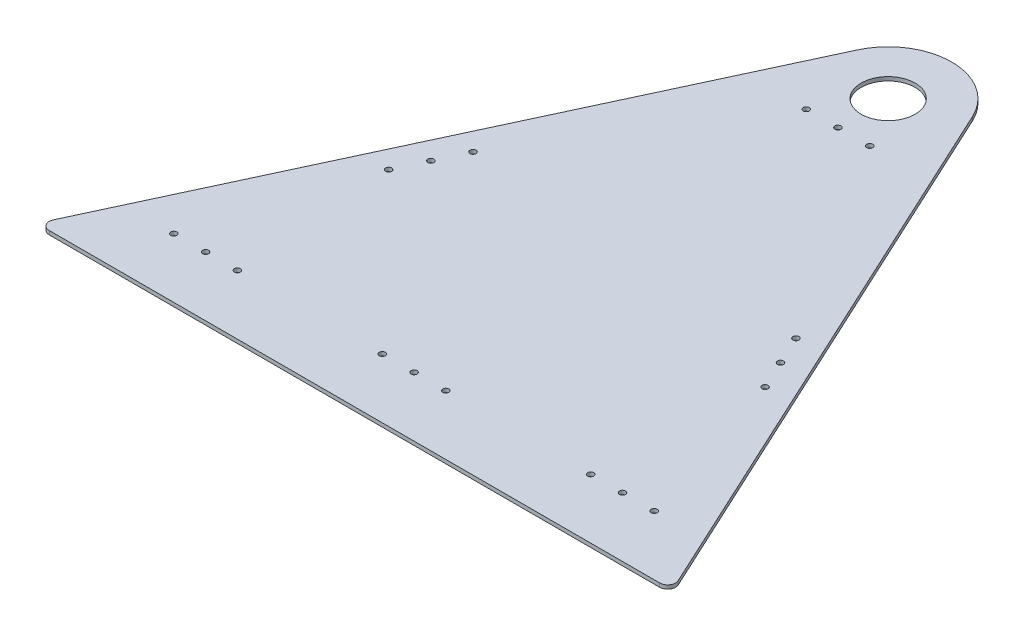
ISO-10303-21;
HEADER;
FILE_DESCRIPTION(('STEP AP214'),'2;1');
FILE_NAME('part.step','',(''),(''),'','','');
FILE_SCHEMA(('AUTOMOTIVE_DESIGN { 1 0 10303 214 1 1 1 1 }'));
ENDSEC;
DATA;
#1=APPLICATION_CONTEXT('core data for automotive mechanical design processes');
#2=APPLICATION_PROTOCOL_DEFINITION('international standard','automotive_design',2000,#1);
#3=PRODUCT_CONTEXT('',#1,'mechanical');
#4=PRODUCT('Part','Part','',(#3));
#5=PRODUCT_RELATED_PRODUCT_CATEGORY('part','',(#4));
#6=PRODUCT_DEFINITION_FORMATION('','',#4);
#7=PRODUCT_DEFINITION_CONTEXT('part definition',#1,'design');
#8=PRODUCT_DEFINITION('design','',#6,#7);
#9=PRODUCT_DEFINITION_SHAPE('','',#8);
#10=(LENGTH_UNIT() NAMED_UNIT(*) SI_UNIT(.MILLI.,.METRE.));
#11=(NAMED_UNIT(*) PLANE_ANGLE_UNIT() SI_UNIT($,.RADIAN.));
#12=(NAMED_UNIT(*) SI_UNIT($,.STERADIAN.) SOLID_ANGLE_UNIT());
#13=UNCERTAINTY_MEASURE_WITH_UNIT(LENGTH_MEASURE(1.E-05),#10,'distance_accuracy_value','');
#14=(GEOMETRIC_REPRESENTATION_CONTEXT(3) GLOBAL_UNCERTAINTY_ASSIGNED_CONTEXT((#13)) GLOBAL_UNIT_ASSIGNED_CONTEXT((#10,
#11,#12)) REPRESENTATION_CONTEXT('',''));
#15=CARTESIAN_POINT('',(0.,0.,0.));
#16=DIRECTION('',(0.,0.,1.));
#17=DIRECTION('',(1.,0.,0.));
#18=AXIS2_PLACEMENT_3D('',#15,#16,#17);
#19=CARTESIAN_POINT('',(254.,-3.03784,-426.72));
#20=DIRECTION('',(0.,1.,0.));
#21=DIRECTION('',(0.,0.,1.));
#22=AXIS2_PLACEMENT_3D('',#19,#20,#21);
#23=CYLINDRICAL_SURFACE('',#22,50.8000000000005);
#24=CARTESIAN_POINT('',(254.,0.,-426.72));
#25=DIRECTION('',(0.,1.,0.));
#26=DIRECTION('',(0.,0.,-1.));
#27=AXIS2_PLACEMENT_3D('',#24,#25,#26);
#28=CIRCLE('',#27,50.8000000000005);
#29=CARTESIAN_POINT('',(300.081092337626,0.,-448.10160258192));
#30=VERTEX_POINT('',#29);
#31=CARTESIAN_POINT('',(207.918907662373,0.,-448.101602581921));
#32=VERTEX_POINT('',#31);
#33=EDGE_CURVE('E123',#30,#32,#28,.T.);
#34=ORIENTED_EDGE('',*,*,#33,.F.);
#35=DIRECTION('',(0.,1.,0.));
#36=VECTOR('',#35,1.);
#37=CARTESIAN_POINT('',(300.081092337626,-3.03784,-448.10160258192));
#38=LINE('',#37,#36);
#39=CARTESIAN_POINT('',(300.081092337626,-3.03784,-448.10160258192));
#40=VERTEX_POINT('',#39);
#41=EDGE_CURVE('E11',#40,#30,#38,.T.);
#42=ORIENTED_EDGE('',*,*,#41,.F.);
#43=CARTESIAN_POINT('',(254.,-3.03784,-426.72));
#44=DIRECTION('',(0.,1.,0.));
#45=DIRECTION('',(0.,0.,-1.));
#46=AXIS2_PLACEMENT_3D('',#43,#44,#45);
#47=CIRCLE('',#46,50.8000000000005);
#48=CARTESIAN_POINT('',(207.918907662373,-3.03784,-448.101602581921));
#49=VERTEX_POINT('',#48);
#50=EDGE_CURVE('E138',#40,#49,#47,.T.);
#51=ORIENTED_EDGE('',*,*,#50,.T.);
#52=DIRECTION('',(0.,1.,0.));
#53=VECTOR('',#52,1.);
#54=CARTESIAN_POINT('',(207.918907662373,-3.03784,-448.101602581921));
#55=LINE('',#54,#53);
#56=EDGE_CURVE('E41',#49,#32,#55,.T.);
#57=ORIENTED_EDGE('',*,*,#56,.T.);
#58=EDGE_LOOP('',(#34,#42,#51,#57));
#59=FACE_BOUND('',#58,.T.);
#60=ADVANCED_FACE('F38',(#59),#23,.T.);
#61=CARTESIAN_POINT('',(300.081092337626,-3.03784,-448.10160258192));
#62=DIRECTION('',(0.907108116882403,0.,-0.420897688620478));
#63=DIRECTION('',(-0.420897688620478,0.,-0.907108116882403));
#64=AXIS2_PLACEMENT_3D('',#61,#62,#63);
#65=PLANE('',#64);
#66=DIRECTION('',(-0.420897688620478,0.,-0.907108116882403));
#67=VECTOR('',#66,1.);
#68=CARTESIAN_POINT('',(300.081092337626,0.,-448.10160258192));
#69=LINE('',#68,#67);
#70=CARTESIAN_POINT('',(503.813471800905,0.,-9.02270032274005));
#71=VERTEX_POINT('',#70);
#72=EDGE_CURVE('E136',#71,#30,#69,.T.);
#73=ORIENTED_EDGE('',*,*,#72,.F.);
#74=DIRECTION('',(0.,1.,0.));
#75=VECTOR('',#74,1.);
#76=CARTESIAN_POINT('',(503.813471800905,-3.03784,-9.02270032274005));
#77=LINE('',#76,#75);
#78=CARTESIAN_POINT('',(503.813471800905,-3.03784,-9.02270032274005));
#79=VERTEX_POINT('',#78);
#80=EDGE_CURVE('E47',#79,#71,#77,.T.);
#81=ORIENTED_EDGE('',*,*,#80,.F.);
#82=DIRECTION('',(-0.420897688620478,0.,-0.907108116882403));
#83=VECTOR('',#82,1.);
#84=CARTESIAN_POINT('',(300.081092337626,-3.03784,-448.10160258192));
#85=LINE('',#84,#83);
#86=EDGE_CURVE('E113',#79,#40,#85,.T.);
#87=ORIENTED_EDGE('',*,*,#86,.T.);
#88=ORIENTED_EDGE('',*,*,#41,.T.);
#89=EDGE_LOOP('',(#73,#81,#87,#88));
#90=FACE_BOUND('',#89,.T.);
#91=ADVANCED_FACE('F146',(#90),#65,.T.);
#92=CARTESIAN_POINT('',(498.053335258701,-3.03784,-6.35000000000002));
#93=DIRECTION('',(0.,1.,0.));
#94=DIRECTION('',(0.,0.,1.));
#95=AXIS2_PLACEMENT_3D('',#92,#93,#94);
#96=CYLINDRICAL_SURFACE('',#95,6.35000000000003);
#97=CARTESIAN_POINT('',(498.053335258701,0.,-6.35000000000002));
#98=DIRECTION('',(0.,1.,0.));
#99=DIRECTION('',(0.,0.,1.));
#100=AXIS2_PLACEMENT_3D('',#97,#98,#99);
#101=CIRCLE('',#100,6.35000000000003);
#102=CARTESIAN_POINT('',(498.053335258701,0.,0.));
#103=VERTEX_POINT('',#102);
#104=EDGE_CURVE('E100',#103,#71,#101,.T.);
#105=ORIENTED_EDGE('',*,*,#104,.F.);
#106=DIRECTION('',(0.,1.,0.));
#107=VECTOR('',#106,1.);
#108=CARTESIAN_POINT('',(498.053335258701,-3.03784,0.));
#109=LINE('',#108,#107);
#110=CARTESIAN_POINT('',(498.053335258701,-3.03784,0.));
#111=VERTEX_POINT('',#110);
#112=EDGE_CURVE('E95',#111,#103,#109,.T.);
#113=ORIENTED_EDGE('',*,*,#112,.F.);
#114=CARTESIAN_POINT('',(498.053335258701,-3.03784,-6.35000000000002));
#115=DIRECTION('',(0.,1.,0.));
#116=DIRECTION('',(0.,0.,1.));
#117=AXIS2_PLACEMENT_3D('',#114,#115,#116);
#118=CIRCLE('',#117,6.35000000000003);
#119=EDGE_CURVE('E98',#111,#79,#118,.T.);
#120=ORIENTED_EDGE('',*,*,#119,.T.);
#121=ORIENTED_EDGE('',*,*,#80,.T.);
#122=EDGE_LOOP('',(#105,#113,#120,#121));
#123=FACE_BOUND('',#122,.T.);
#124=ADVANCED_FACE('F97',(#123),#96,.T.);
#125=CARTESIAN_POINT('',(9.94666474129868,-3.03784,0.));
#126=DIRECTION('',(0.,0.,1.));
#127=DIRECTION('',(1.,0.,0.));
#128=AXIS2_PLACEMENT_3D('',#125,#126,#127);
#129=PLANE('',#128);
#130=DIRECTION('',(1.,0.,0.));
#131=VECTOR('',#130,1.);
#132=CARTESIAN_POINT('',(9.94666474129868,0.,0.));
#133=LINE('',#132,#131);
#134=CARTESIAN_POINT('',(9.94666474129868,0.,0.));
#135=VERTEX_POINT('',#134);
#136=EDGE_CURVE('E133',#135,#103,#133,.T.);
#137=ORIENTED_EDGE('',*,*,#136,.F.);
#138=DIRECTION('',(0.,1.,0.));
#139=VECTOR('',#138,1.);
#140=CARTESIAN_POINT('',(9.94666474129868,-3.03784,0.));
#141=LINE('',#140,#139);
#142=CARTESIAN_POINT('',(9.94666474129868,-3.03784,0.));
#143=VERTEX_POINT('',#142);
#144=EDGE_CURVE('E105',#143,#135,#141,.T.);
#145=ORIENTED_EDGE('',*,*,#144,.F.);
#146=DIRECTION('',(1.,0.,0.));
#147=VECTOR('',#146,1.);
#148=CARTESIAN_POINT('',(9.94666474129868,-3.03784,0.));
#149=LINE('',#148,#147);
#150=EDGE_CURVE('E111',#143,#111,#149,.T.);
#151=ORIENTED_EDGE('',*,*,#150,.T.);
#152=ORIENTED_EDGE('',*,*,#112,.T.);
#153=EDGE_LOOP('',(#137,#145,#151,#152));
#154=FACE_BOUND('',#153,.T.);
#155=ADVANCED_FACE('F115',(#154),#129,.T.);
#156=CARTESIAN_POINT('',(9.94666474129868,-3.03784,-6.35000000000002));
#157=DIRECTION('',(0.,1.,0.));
#158=DIRECTION('',(0.,0.,1.));
#159=AXIS2_PLACEMENT_3D('',#156,#157,#158);
#160=CYLINDRICAL_SURFACE('',#159,6.35000000000002);
#161=CARTESIAN_POINT('',(9.94666474129868,0.,-6.35000000000002));
#162=DIRECTION('',(0.,1.,0.));
#163=DIRECTION('',(0.,0.,-1.));
#164=AXIS2_PLACEMENT_3D('',#161,#162,#163);
#165=CIRCLE('',#164,6.35000000000002);
#166=CARTESIAN_POINT('',(4.1865281990954,0.,-9.02270032274006));
#167=VERTEX_POINT('',#166);
#168=EDGE_CURVE('E130',#167,#135,#165,.T.);
#169=ORIENTED_EDGE('',*,*,#168,.F.);
#170=DIRECTION('',(0.,1.,0.));
#171=VECTOR('',#170,1.);
#172=CARTESIAN_POINT('',(4.1865281990954,-3.03784,-9.02270032274006));
#173=LINE('',#172,#171);
#174=CARTESIAN_POINT('',(4.1865281990954,-3.03784,-9.02270032274006));
#175=VERTEX_POINT('',#174);
#176=EDGE_CURVE('E141',#175,#167,#173,.T.);
#177=ORIENTED_EDGE('',*,*,#176,.F.);
#178=CARTESIAN_POINT('',(9.94666474129868,-3.03784,-6.35000000000002));
#179=DIRECTION('',(0.,1.,0.));
#180=DIRECTION('',(0.,0.,-1.));
#181=AXIS2_PLACEMENT_3D('',#178,#179,#180);
#182=CIRCLE('',#181,6.35000000000002);
#183=EDGE_CURVE('E116',#175,#143,#182,.T.);
#184=ORIENTED_EDGE('',*,*,#183,.T.);
#185=ORIENTED_EDGE('',*,*,#144,.T.);
#186=EDGE_LOOP('',(#169,#177,#184,#185));
#187=FACE_BOUND('',#186,.T.);
#188=ADVANCED_FACE('F159',(#187),#160,.T.);
#189=CARTESIAN_POINT('',(4.1865281990954,-3.03784,-9.02270032274006));
#190=DIRECTION('',(-0.907108116882404,0.,-0.420897688620476));
#191=DIRECTION('',(-0.420897688620476,0.,0.907108116882404));
#192=AXIS2_PLACEMENT_3D('',#189,#190,#191);
#193=PLANE('',#192);
#194=DIRECTION('',(-0.420897688620476,0.,0.907108116882404));
#195=VECTOR('',#194,1.);
#196=CARTESIAN_POINT('',(4.1865281990954,0.,-9.02270032274006));
#197=LINE('',#196,#195);
#198=EDGE_CURVE('E126',#32,#167,#197,.T.);
#199=ORIENTED_EDGE('',*,*,#198,.F.);
#200=ORIENTED_EDGE('',*,*,#56,.F.);
#201=DIRECTION('',(-0.420897688620476,0.,0.907108116882404));
#202=VECTOR('',#201,1.);
#203=CARTESIAN_POINT('',(4.1865281990954,-3.03784,-9.02270032274006));
#204=LINE('',#203,#202);
#205=EDGE_CURVE('E118',#49,#175,#204,.T.);
#206=ORIENTED_EDGE('',*,*,#205,.T.);
#207=ORIENTED_EDGE('',*,*,#176,.T.);
#208=EDGE_LOOP('',(#199,#200,#206,#207));
#209=FACE_BOUND('',#208,.T.);
#210=ADVANCED_FACE('F143',(#209),#193,.T.);
#211=CARTESIAN_POINT('',(254.,-3.03784,-426.72));
#212=DIRECTION('',(0.,-1.,0.));
#213=DIRECTION('',(0.,0.,-1.));
#214=AXIS2_PLACEMENT_3D('',#211,#212,#213);
#215=PLANE('',#214);
#216=CARTESIAN_POINT('',(228.6,-3.03784,-386.588000012053));
#217=DIRECTION('',(0.,1.,0.));
#218=DIRECTION('',(0.,0.,1.));
#219=AXIS2_PLACEMENT_3D('',#216,#217,#218);
#220=CIRCLE('',#219,2.4257);
#221=CARTESIAN_POINT('',(228.6,-3.03784,-384.162300012053));
#222=VERTEX_POINT('',#221);
#223=EDGE_CURVE('E253',#222,#222,#220,.T.);
#224=ORIENTED_EDGE('',*,*,#223,.T.);
#225=EDGE_LOOP('',(#224));
#226=FACE_BOUND('',#225,.T.);
#227=CARTESIAN_POINT('',(254.,-3.03784,-386.588000012053));
#228=DIRECTION('',(0.,1.,0.));
#229=DIRECTION('',(0.,0.,1.));
#230=AXIS2_PLACEMENT_3D('',#227,#228,#229);
#231=CIRCLE('',#230,2.42569999999998);
#232=CARTESIAN_POINT('',(254.,-3.03784,-384.162300012053));
#233=VERTEX_POINT('',#232);
#234=EDGE_CURVE('E263',#233,#233,#231,.T.);
#235=ORIENTED_EDGE('',*,*,#234,.T.);
#236=EDGE_LOOP('',(#235));
#237=FACE_BOUND('',#236,.T.);
#238=CARTESIAN_POINT('',(279.4,-3.03784,-386.588000012053));
#239=DIRECTION('',(0.,1.,0.));
#240=DIRECTION('',(0.,0.,1.));
#241=AXIS2_PLACEMENT_3D('',#238,#239,#240);
#242=CIRCLE('',#241,2.42569999999998);
#243=CARTESIAN_POINT('',(279.4,-3.03784,-384.162300012053));
#244=VERTEX_POINT('',#243);
#245=EDGE_CURVE('E269',#244,#244,#242,.T.);
#246=ORIENTED_EDGE('',*,*,#245,.T.);
#247=EDGE_LOOP('',(#246));
#248=FACE_BOUND('',#247,.T.);
#249=CARTESIAN_POINT('',(61.9478853665862,-3.03784,-47.625));
#250=DIRECTION('',(0.,1.,0.));
#251=DIRECTION('',(0.,0.,1.));
#252=AXIS2_PLACEMENT_3D('',#249,#250,#251);
#253=CIRCLE('',#252,2.4257);
#254=CARTESIAN_POINT('',(61.9478853665862,-3.03784,-45.1993));
#255=VERTEX_POINT('',#254);
#256=EDGE_CURVE('E275',#255,#255,#253,.T.);
#257=ORIENTED_EDGE('',*,*,#256,.T.);
#258=EDGE_LOOP('',(#257));
#259=FACE_BOUND('',#258,.T.);
#260=CARTESIAN_POINT('',(87.3478853665862,-3.03784,-47.625));
#261=DIRECTION('',(0.,1.,0.));
#262=DIRECTION('',(0.,0.,1.));
#263=AXIS2_PLACEMENT_3D('',#260,#261,#262);
#264=CIRCLE('',#263,2.4257);
#265=CARTESIAN_POINT('',(87.3478853665862,-3.03784,-45.1993));
#266=VERTEX_POINT('',#265);
#267=EDGE_CURVE('E281',#266,#266,#264,.T.);
#268=ORIENTED_EDGE('',*,*,#267,.T.);
#269=EDGE_LOOP('',(#268));
#270=FACE_BOUND('',#269,.T.);
#271=CARTESIAN_POINT('',(112.747885366586,-3.03784,-47.625));
#272=DIRECTION('',(0.,1.,0.));
#273=DIRECTION('',(0.,0.,1.));
#274=AXIS2_PLACEMENT_3D('',#271,#272,#273);
#275=CIRCLE('',#274,2.4257);
#276=CARTESIAN_POINT('',(112.747885366586,-3.03784,-45.1993));
#277=VERTEX_POINT('',#276);
#278=EDGE_CURVE('E287',#277,#277,#275,.T.);
#279=ORIENTED_EDGE('',*,*,#278,.T.);
#280=EDGE_LOOP('',(#279));
#281=FACE_BOUND('',#280,.T.);
#282=CARTESIAN_POINT('',(228.6,-3.03784,-47.625));
#283=DIRECTION('',(0.,1.,0.));
#284=DIRECTION('',(0.,0.,1.));
#285=AXIS2_PLACEMENT_3D('',#282,#283,#284);
#286=CIRCLE('',#285,2.4257);
#287=CARTESIAN_POINT('',(228.6,-3.03784,-45.1993));
#288=VERTEX_POINT('',#287);
#289=EDGE_CURVE('E293',#288,#288,#286,.T.);
#290=ORIENTED_EDGE('',*,*,#289,.T.);
#291=EDGE_LOOP('',(#290));
#292=FACE_BOUND('',#291,.T.);
#293=CARTESIAN_POINT('',(254.,-3.03784,-47.625));
#294=DIRECTION('',(0.,1.,0.));
#295=DIRECTION('',(0.,0.,1.));
#296=AXIS2_PLACEMENT_3D('',#293,#294,#295);
#297=CIRCLE('',#296,2.42569999999998);
#298=CARTESIAN_POINT('',(254.,-3.03784,-45.1993));
#299=VERTEX_POINT('',#298);
#300=EDGE_CURVE('E299',#299,#299,#297,.T.);
#301=ORIENTED_EDGE('',*,*,#300,.T.);
#302=EDGE_LOOP('',(#301));
#303=FACE_BOUND('',#302,.T.);
#304=CARTESIAN_POINT('',(446.052114633414,-3.03784,-47.625));
#305=DIRECTION('',(0.,1.,0.));
#306=DIRECTION('',(0.,0.,1.));
#307=AXIS2_PLACEMENT_3D('',#304,#305,#306);
#308=CIRCLE('',#307,2.42569999999998);
#309=CARTESIAN_POINT('',(446.052114633414,-3.03784,-45.1993));
#310=VERTEX_POINT('',#309);
#311=EDGE_CURVE('E305',#310,#310,#308,.T.);
#312=ORIENTED_EDGE('',*,*,#311,.T.);
#313=EDGE_LOOP('',(#312));
#314=FACE_BOUND('',#313,.T.);
#315=CARTESIAN_POINT('',(420.652114633414,-3.03784,-47.625));
#316=DIRECTION('',(0.,1.,0.));
#317=DIRECTION('',(0.,0.,1.));
#318=AXIS2_PLACEMENT_3D('',#315,#316,#317);
#319=CIRCLE('',#318,2.42569999999998);
#320=CARTESIAN_POINT('',(420.652114633414,-3.03784,-45.1993));
#321=VERTEX_POINT('',#320);
#322=EDGE_CURVE('E311',#321,#321,#319,.T.);
#323=ORIENTED_EDGE('',*,*,#322,.T.);
#324=EDGE_LOOP('',(#323));
#325=FACE_BOUND('',#324,.T.);
#326=CARTESIAN_POINT('',(395.252114633414,-3.03784,-47.625));
#327=DIRECTION('',(0.,1.,0.));
#328=DIRECTION('',(0.,0.,1.));
#329=AXIS2_PLACEMENT_3D('',#326,#327,#328);
#330=CIRCLE('',#329,2.42569999999998);
#331=CARTESIAN_POINT('',(395.252114633414,-3.03784,-45.1993));
#332=VERTEX_POINT('',#331);
#333=EDGE_CURVE('E317',#332,#332,#330,.T.);
#334=ORIENTED_EDGE('',*,*,#333,.T.);
#335=EDGE_LOOP('',(#334));
#336=FACE_BOUND('',#335,.T.);
#337=CARTESIAN_POINT('',(279.4,-3.03784,-47.625));
#338=DIRECTION('',(0.,1.,0.));
#339=DIRECTION('',(0.,0.,1.));
#340=AXIS2_PLACEMENT_3D('',#337,#338,#339);
#341=CIRCLE('',#340,2.42569999999998);
#342=CARTESIAN_POINT('',(279.4,-3.03784,-45.1993));
#343=VERTEX_POINT('',#342);
#344=EDGE_CURVE('E323',#343,#343,#341,.T.);
#345=ORIENTED_EDGE('',*,*,#344,.T.);
#346=EDGE_LOOP('',(#345));
#347=FACE_BOUND('',#346,.T.);
#348=CARTESIAN_POINT('',(103.499910638427,-3.03784,-177.8));
#349=DIRECTION('',(0.,1.,0.));
#350=DIRECTION('',(0.,0.,1.));
#351=AXIS2_PLACEMENT_3D('',#348,#349,#350);
#352=CIRCLE('',#351,2.4257);
#353=CARTESIAN_POINT('',(103.499910638427,-3.03784,-175.3743));
#354=VERTEX_POINT('',#353);
#355=EDGE_CURVE('E329',#354,#354,#352,.T.);
#356=ORIENTED_EDGE('',*,*,#355,.T.);
#357=EDGE_LOOP('',(#356));
#358=FACE_BOUND('',#357,.T.);
#359=CARTESIAN_POINT('',(114.190711929388,-3.03784,-200.840546168813));
#360=DIRECTION('',(0.,1.,0.));
#361=DIRECTION('',(0.,0.,1.));
#362=AXIS2_PLACEMENT_3D('',#359,#360,#361);
#363=CIRCLE('',#362,2.4257);
#364=CARTESIAN_POINT('',(114.190711929388,-3.03784,-198.414846168813));
#365=VERTEX_POINT('',#364);
#366=EDGE_CURVE('E335',#365,#365,#363,.T.);
#367=ORIENTED_EDGE('',*,*,#366,.T.);
#368=EDGE_LOOP('',(#367));
#369=FACE_BOUND('',#368,.T.);
#370=CARTESIAN_POINT('',(124.881513220348,-3.03784,-223.881092337626));
#371=DIRECTION('',(0.,1.,0.));
#372=DIRECTION('',(0.,0.,1.));
#373=AXIS2_PLACEMENT_3D('',#370,#371,#372);
#374=CIRCLE('',#373,2.42569999999999);
#375=CARTESIAN_POINT('',(124.881513220348,-3.03784,-221.455392337626));
#376=VERTEX_POINT('',#375);
#377=EDGE_CURVE('E341',#376,#376,#374,.T.);
#378=ORIENTED_EDGE('',*,*,#377,.T.);
#379=EDGE_LOOP('',(#378));
#380=FACE_BOUND('',#379,.T.);
#381=CARTESIAN_POINT('',(404.500089361573,-3.03784,-177.8));
#382=DIRECTION('',(0.,1.,0.));
#383=DIRECTION('',(0.,0.,1.));
#384=AXIS2_PLACEMENT_3D('',#381,#382,#383);
#385=CIRCLE('',#384,2.42569999999998);
#386=CARTESIAN_POINT('',(404.500089361573,-3.03784,-175.3743));
#387=VERTEX_POINT('',#386);
#388=EDGE_CURVE('E347',#387,#387,#385,.T.);
#389=ORIENTED_EDGE('',*,*,#388,.T.);
#390=EDGE_LOOP('',(#389));
#391=FACE_BOUND('',#390,.T.);
#392=CARTESIAN_POINT('',(393.809288070613,-3.03784,-200.840546168813));
#393=DIRECTION('',(0.,1.,0.));
#394=DIRECTION('',(0.,0.,1.));
#395=AXIS2_PLACEMENT_3D('',#392,#393,#394);
#396=CIRCLE('',#395,2.42569999999998);
#397=CARTESIAN_POINT('',(393.809288070613,-3.03784,-198.414846168813));
#398=VERTEX_POINT('',#397);
#399=EDGE_CURVE('E353',#398,#398,#396,.T.);
#400=ORIENTED_EDGE('',*,*,#399,.T.);
#401=EDGE_LOOP('',(#400));
#402=FACE_BOUND('',#401,.T.);
#403=CARTESIAN_POINT('',(383.118486779652,-3.03784,-223.881092337626));
#404=DIRECTION('',(0.,1.,0.));
#405=DIRECTION('',(0.,0.,1.));
#406=AXIS2_PLACEMENT_3D('',#403,#404,#405);
#407=CIRCLE('',#406,2.42569999999998);
#408=CARTESIAN_POINT('',(383.118486779652,-3.03784,-221.455392337626));
#409=VERTEX_POINT('',#408);
#410=EDGE_CURVE('E359',#409,#409,#407,.T.);
#411=ORIENTED_EDGE('',*,*,#410,.T.);
#412=EDGE_LOOP('',(#411));
#413=FACE_BOUND('',#412,.T.);
#414=CARTESIAN_POINT('',(254.,-3.03784,-426.72));
#415=DIRECTION('',(0.,1.,0.));
#416=DIRECTION('',(0.,0.,1.));
#417=AXIS2_PLACEMENT_3D('',#414,#415,#416);
#418=CIRCLE('',#417,21.59);
#419=CARTESIAN_POINT('',(254.,-3.03784,-405.13));
#420=VERTEX_POINT('',#419);
#421=EDGE_CURVE('E127',#420,#420,#418,.T.);
#422=ORIENTED_EDGE('',*,*,#421,.T.);
#423=EDGE_LOOP('',(#422));
#424=FACE_BOUND('',#423,.T.);
#425=ORIENTED_EDGE('',*,*,#50,.F.);
#426=ORIENTED_EDGE('',*,*,#86,.F.);
#427=ORIENTED_EDGE('',*,*,#119,.F.);
#428=ORIENTED_EDGE('',*,*,#150,.F.);
#429=ORIENTED_EDGE('',*,*,#183,.F.);
#430=ORIENTED_EDGE('',*,*,#205,.F.);
#431=EDGE_LOOP('',(#425,#426,#427,#428,#429,#430));
#432=FACE_BOUND('',#431,.T.);
#433=ADVANCED_FACE('F109',(#226,#237,#248,#259,#270,#281,#292,#303,#314,#325,#336,#347,#358,
#369,#380,#391,#402,#413,#424,#432),#215,.T.);
#434=CARTESIAN_POINT('',(254.,0.,-426.72));
#435=DIRECTION('',(0.,-1.,0.));
#436=DIRECTION('',(0.,0.,-1.));
#437=AXIS2_PLACEMENT_3D('',#434,#435,#436);
#438=PLANE('',#437);
#439=CARTESIAN_POINT('',(228.6,0.,-386.588000012053));
#440=DIRECTION('',(0.,1.,0.));
#441=DIRECTION('',(0.,0.,1.));
#442=AXIS2_PLACEMENT_3D('',#439,#440,#441);
#443=CIRCLE('',#442,2.4257);
#444=CARTESIAN_POINT('',(228.6,0.,-384.162300012053));
#445=VERTEX_POINT('',#444);
#446=EDGE_CURVE('E256',#445,#445,#443,.T.);
#447=ORIENTED_EDGE('',*,*,#446,.F.);
#448=EDGE_LOOP('',(#447));
#449=FACE_BOUND('',#448,.T.);
#450=CARTESIAN_POINT('',(254.,0.,-386.588000012053));
#451=DIRECTION('',(0.,1.,0.));
#452=DIRECTION('',(0.,0.,1.));
#453=AXIS2_PLACEMENT_3D('',#450,#451,#452);
#454=CIRCLE('',#453,2.42569999999998);
#455=CARTESIAN_POINT('',(254.,0.,-384.162300012053));
#456=VERTEX_POINT('',#455);
#457=EDGE_CURVE('E258',#456,#456,#454,.T.);
#458=ORIENTED_EDGE('',*,*,#457,.F.);
#459=EDGE_LOOP('',(#458));
#460=FACE_BOUND('',#459,.T.);
#461=CARTESIAN_POINT('',(279.4,0.,-386.588000012053));
#462=DIRECTION('',(0.,1.,0.));
#463=DIRECTION('',(0.,0.,1.));
#464=AXIS2_PLACEMENT_3D('',#461,#462,#463);
#465=CIRCLE('',#464,2.42569999999998);
#466=CARTESIAN_POINT('',(279.4,0.,-384.162300012053));
#467=VERTEX_POINT('',#466);
#468=EDGE_CURVE('E266',#467,#467,#465,.T.);
#469=ORIENTED_EDGE('',*,*,#468,.F.);
#470=EDGE_LOOP('',(#469));
#471=FACE_BOUND('',#470,.T.);
#472=CARTESIAN_POINT('',(61.9478853665862,0.,-47.625));
#473=DIRECTION('',(0.,1.,0.));
#474=DIRECTION('',(0.,0.,1.));
#475=AXIS2_PLACEMENT_3D('',#472,#473,#474);
#476=CIRCLE('',#475,2.4257);
#477=CARTESIAN_POINT('',(61.9478853665862,0.,-45.1993));
#478=VERTEX_POINT('',#477);
#479=EDGE_CURVE('E272',#478,#478,#476,.T.);
#480=ORIENTED_EDGE('',*,*,#479,.F.);
#481=EDGE_LOOP('',(#480));
#482=FACE_BOUND('',#481,.T.);
#483=CARTESIAN_POINT('',(87.3478853665862,0.,-47.625));
#484=DIRECTION('',(0.,1.,0.));
#485=DIRECTION('',(0.,0.,1.));
#486=AXIS2_PLACEMENT_3D('',#483,#484,#485);
#487=CIRCLE('',#486,2.4257);
#488=CARTESIAN_POINT('',(87.3478853665862,0.,-45.1993));
#489=VERTEX_POINT('',#488);
#490=EDGE_CURVE('E278',#489,#489,#487,.T.);
#491=ORIENTED_EDGE('',*,*,#490,.F.);
#492=EDGE_LOOP('',(#491));
#493=FACE_BOUND('',#492,.T.);
#494=CARTESIAN_POINT('',(112.747885366586,0.,-47.625));
#495=DIRECTION('',(0.,1.,0.));
#496=DIRECTION('',(0.,0.,1.));
#497=AXIS2_PLACEMENT_3D('',#494,#495,#496);
#498=CIRCLE('',#497,2.4257);
#499=CARTESIAN_POINT('',(112.747885366586,0.,-45.1993));
#500=VERTEX_POINT('',#499);
#501=EDGE_CURVE('E284',#500,#500,#498,.T.);
#502=ORIENTED_EDGE('',*,*,#501,.F.);
#503=EDGE_LOOP('',(#502));
#504=FACE_BOUND('',#503,.T.);
#505=CARTESIAN_POINT('',(228.6,0.,-47.625));
#506=DIRECTION('',(0.,1.,0.));
#507=DIRECTION('',(0.,0.,1.));
#508=AXIS2_PLACEMENT_3D('',#505,#506,#507);
#509=CIRCLE('',#508,2.4257);
#510=CARTESIAN_POINT('',(228.6,0.,-45.1993));
#511=VERTEX_POINT('',#510);
#512=EDGE_CURVE('E290',#511,#511,#509,.T.);
#513=ORIENTED_EDGE('',*,*,#512,.F.);
#514=EDGE_LOOP('',(#513));
#515=FACE_BOUND('',#514,.T.);
#516=CARTESIAN_POINT('',(254.,0.,-47.625));
#517=DIRECTION('',(0.,1.,0.));
#518=DIRECTION('',(0.,0.,1.));
#519=AXIS2_PLACEMENT_3D('',#516,#517,#518);
#520=CIRCLE('',#519,2.42569999999998);
#521=CARTESIAN_POINT('',(254.,0.,-45.1993));
#522=VERTEX_POINT('',#521);
#523=EDGE_CURVE('E296',#522,#522,#520,.T.);
#524=ORIENTED_EDGE('',*,*,#523,.F.);
#525=EDGE_LOOP('',(#524));
#526=FACE_BOUND('',#525,.T.);
#527=CARTESIAN_POINT('',(446.052114633414,0.,-47.625));
#528=DIRECTION('',(0.,1.,0.));
#529=DIRECTION('',(0.,0.,1.));
#530=AXIS2_PLACEMENT_3D('',#527,#528,#529);
#531=CIRCLE('',#530,2.42569999999998);
#532=CARTESIAN_POINT('',(446.052114633414,0.,-45.1993));
#533=VERTEX_POINT('',#532);
#534=EDGE_CURVE('E302',#533,#533,#531,.T.);
#535=ORIENTED_EDGE('',*,*,#534,.F.);
#536=EDGE_LOOP('',(#535));
#537=FACE_BOUND('',#536,.T.);
#538=CARTESIAN_POINT('',(420.652114633414,0.,-47.625));
#539=DIRECTION('',(0.,1.,0.));
#540=DIRECTION('',(0.,0.,1.));
#541=AXIS2_PLACEMENT_3D('',#538,#539,#540);
#542=CIRCLE('',#541,2.42569999999998);
#543=CARTESIAN_POINT('',(420.652114633414,0.,-45.1993));
#544=VERTEX_POINT('',#543);
#545=EDGE_CURVE('E308',#544,#544,#542,.T.);
#546=ORIENTED_EDGE('',*,*,#545,.F.);
#547=EDGE_LOOP('',(#546));
#548=FACE_BOUND('',#547,.T.);
#549=CARTESIAN_POINT('',(395.252114633414,0.,-47.625));
#550=DIRECTION('',(0.,1.,0.));
#551=DIRECTION('',(0.,0.,1.));
#552=AXIS2_PLACEMENT_3D('',#549,#550,#551);
#553=CIRCLE('',#552,2.42569999999998);
#554=CARTESIAN_POINT('',(395.252114633414,0.,-45.1993));
#555=VERTEX_POINT('',#554);
#556=EDGE_CURVE('E314',#555,#555,#553,.T.);
#557=ORIENTED_EDGE('',*,*,#556,.F.);
#558=EDGE_LOOP('',(#557));
#559=FACE_BOUND('',#558,.T.);
#560=CARTESIAN_POINT('',(279.4,0.,-47.625));
#561=DIRECTION('',(0.,1.,0.));
#562=DIRECTION('',(0.,0.,1.));
#563=AXIS2_PLACEMENT_3D('',#560,#561,#562);
#564=CIRCLE('',#563,2.42569999999998);
#565=CARTESIAN_POINT('',(279.4,0.,-45.1993));
#566=VERTEX_POINT('',#565);
#567=EDGE_CURVE('E320',#566,#566,#564,.T.);
#568=ORIENTED_EDGE('',*,*,#567,.F.);
#569=EDGE_LOOP('',(#568));
#570=FACE_BOUND('',#569,.T.);
#571=CARTESIAN_POINT('',(103.499910638427,0.,-177.8));
#572=DIRECTION('',(0.,1.,0.));
#573=DIRECTION('',(0.,0.,1.));
#574=AXIS2_PLACEMENT_3D('',#571,#572,#573);
#575=CIRCLE('',#574,2.4257);
#576=CARTESIAN_POINT('',(103.499910638427,0.,-175.3743));
#577=VERTEX_POINT('',#576);
#578=EDGE_CURVE('E326',#577,#577,#575,.T.);
#579=ORIENTED_EDGE('',*,*,#578,.F.);
#580=EDGE_LOOP('',(#579));
#581=FACE_BOUND('',#580,.T.);
#582=CARTESIAN_POINT('',(114.190711929388,0.,-200.840546168813));
#583=DIRECTION('',(0.,1.,0.));
#584=DIRECTION('',(0.,0.,1.));
#585=AXIS2_PLACEMENT_3D('',#582,#583,#584);
#586=CIRCLE('',#585,2.4257);
#587=CARTESIAN_POINT('',(114.190711929388,0.,-198.414846168813));
#588=VERTEX_POINT('',#587);
#589=EDGE_CURVE('E332',#588,#588,#586,.T.);
#590=ORIENTED_EDGE('',*,*,#589,.F.);
#591=EDGE_LOOP('',(#590));
#592=FACE_BOUND('',#591,.T.);
#593=CARTESIAN_POINT('',(124.881513220348,0.,-223.881092337626));
#594=DIRECTION('',(0.,1.,0.));
#595=DIRECTION('',(0.,0.,1.));
#596=AXIS2_PLACEMENT_3D('',#593,#594,#595);
#597=CIRCLE('',#596,2.42569999999999);
#598=CARTESIAN_POINT('',(124.881513220348,0.,-221.455392337626));
#599=VERTEX_POINT('',#598);
#600=EDGE_CURVE('E338',#599,#599,#597,.T.);
#601=ORIENTED_EDGE('',*,*,#600,.F.);
#602=EDGE_LOOP('',(#601));
#603=FACE_BOUND('',#602,.T.);
#604=CARTESIAN_POINT('',(404.500089361573,0.,-177.8));
#605=DIRECTION('',(0.,1.,0.));
#606=DIRECTION('',(0.,0.,1.));
#607=AXIS2_PLACEMENT_3D('',#604,#605,#606);
#608=CIRCLE('',#607,2.42569999999998);
#609=CARTESIAN_POINT('',(404.500089361573,0.,-175.3743));
#610=VERTEX_POINT('',#609);
#611=EDGE_CURVE('E344',#610,#610,#608,.T.);
#612=ORIENTED_EDGE('',*,*,#611,.F.);
#613=EDGE_LOOP('',(#612));
#614=FACE_BOUND('',#613,.T.);
#615=CARTESIAN_POINT('',(393.809288070613,0.,-200.840546168813));
#616=DIRECTION('',(0.,1.,0.));
#617=DIRECTION('',(0.,0.,1.));
#618=AXIS2_PLACEMENT_3D('',#615,#616,#617);
#619=CIRCLE('',#618,2.42569999999998);
#620=CARTESIAN_POINT('',(393.809288070613,0.,-198.414846168813));
#621=VERTEX_POINT('',#620);
#622=EDGE_CURVE('E350',#621,#621,#619,.T.);
#623=ORIENTED_EDGE('',*,*,#622,.F.);
#624=EDGE_LOOP('',(#623));
#625=FACE_BOUND('',#624,.T.);
#626=CARTESIAN_POINT('',(383.118486779652,0.,-223.881092337626));
#627=DIRECTION('',(0.,1.,0.));
#628=DIRECTION('',(0.,0.,1.));
#629=AXIS2_PLACEMENT_3D('',#626,#627,#628);
#630=CIRCLE('',#629,2.42569999999998);
#631=CARTESIAN_POINT('',(383.118486779652,0.,-221.455392337626));
#632=VERTEX_POINT('',#631);
#633=EDGE_CURVE('E356',#632,#632,#630,.T.);
#634=ORIENTED_EDGE('',*,*,#633,.F.);
#635=EDGE_LOOP('',(#634));
#636=FACE_BOUND('',#635,.T.);
#637=CARTESIAN_POINT('',(254.,0.,-426.72));
#638=DIRECTION('',(0.,1.,0.));
#639=DIRECTION('',(0.,0.,1.));
#640=AXIS2_PLACEMENT_3D('',#637,#638,#639);
#641=CIRCLE('',#640,21.59);
#642=CARTESIAN_POINT('',(254.,0.,-405.13));
#643=VERTEX_POINT('',#642);
#644=EDGE_CURVE('E362',#643,#643,#641,.T.);
#645=ORIENTED_EDGE('',*,*,#644,.F.);
#646=EDGE_LOOP('',(#645));
#647=FACE_BOUND('',#646,.T.);
#648=ORIENTED_EDGE('',*,*,#33,.T.);
#649=ORIENTED_EDGE('',*,*,#198,.T.);
#650=ORIENTED_EDGE('',*,*,#168,.T.);
#651=ORIENTED_EDGE('',*,*,#136,.T.);
#652=ORIENTED_EDGE('',*,*,#104,.T.);
#653=ORIENTED_EDGE('',*,*,#72,.T.);
#654=EDGE_LOOP('',(#648,#649,#650,#651,#652,#653));
#655=FACE_BOUND('',#654,.T.);
#656=ADVANCED_FACE('F145',(#449,#460,#471,#482,#493,#504,#515,#526,#537,#548,#559,#570,#581,
#592,#603,#614,#625,#636,#647,#655),#438,.F.);
#657=CARTESIAN_POINT('',(254.,-3.03784,-426.72));
#658=DIRECTION('',(0.,1.,0.));
#659=DIRECTION('',(0.,0.,1.));
#660=AXIS2_PLACEMENT_3D('',#657,#658,#659);
#661=CYLINDRICAL_SURFACE('',#660,21.59);
#662=ORIENTED_EDGE('',*,*,#421,.F.);
#663=EDGE_LOOP('',(#662));
#664=FACE_BOUND('',#663,.T.);
#665=ORIENTED_EDGE('',*,*,#644,.T.);
#666=EDGE_LOOP('',(#665));
#667=FACE_BOUND('',#666,.T.);
#668=ADVANCED_FACE('F170',(#664,#667),#661,.F.);
#669=CARTESIAN_POINT('',(383.118486779652,0.,-223.881092337626));
#670=DIRECTION('',(0.,1.,0.));
#671=DIRECTION('',(0.,0.,1.));
#672=AXIS2_PLACEMENT_3D('',#669,#670,#671);
#673=CYLINDRICAL_SURFACE('',#672,2.42569999999998);
#674=ORIENTED_EDGE('',*,*,#410,.F.);
#675=EDGE_LOOP('',(#674));
#676=FACE_BOUND('',#675,.T.);
#677=ORIENTED_EDGE('',*,*,#633,.T.);
#678=EDGE_LOOP('',(#677));
#679=FACE_BOUND('',#678,.T.);
#680=ADVANCED_FACE('F177',(#676,#679),#673,.F.);
#681=CARTESIAN_POINT('',(393.809288070613,0.,-200.840546168813));
#682=DIRECTION('',(0.,1.,0.));
#683=DIRECTION('',(0.,0.,1.));
#684=AXIS2_PLACEMENT_3D('',#681,#682,#683);
#685=CYLINDRICAL_SURFACE('',#684,2.42569999999998);
#686=ORIENTED_EDGE('',*,*,#399,.F.);
#687=EDGE_LOOP('',(#686));
#688=FACE_BOUND('',#687,.T.);
#689=ORIENTED_EDGE('',*,*,#622,.T.);
#690=EDGE_LOOP('',(#689));
#691=FACE_BOUND('',#690,.T.);
#692=ADVANCED_FACE('F181',(#688,#691),#685,.F.);
#693=CARTESIAN_POINT('',(404.500089361573,0.,-177.8));
#694=DIRECTION('',(0.,1.,0.));
#695=DIRECTION('',(0.,0.,1.));
#696=AXIS2_PLACEMENT_3D('',#693,#694,#695);
#697=CYLINDRICAL_SURFACE('',#696,2.42569999999998);
#698=ORIENTED_EDGE('',*,*,#388,.F.);
#699=EDGE_LOOP('',(#698));
#700=FACE_BOUND('',#699,.T.);
#701=ORIENTED_EDGE('',*,*,#611,.T.);
#702=EDGE_LOOP('',(#701));
#703=FACE_BOUND('',#702,.T.);
#704=ADVANCED_FACE('F185',(#700,#703),#697,.F.);
#705=CARTESIAN_POINT('',(124.881513220348,0.,-223.881092337626));
#706=DIRECTION('',(0.,1.,0.));
#707=DIRECTION('',(0.,0.,1.));
#708=AXIS2_PLACEMENT_3D('',#705,#706,#707);
#709=CYLINDRICAL_SURFACE('',#708,2.42569999999999);
#710=ORIENTED_EDGE('',*,*,#377,.F.);
#711=EDGE_LOOP('',(#710));
#712=FACE_BOUND('',#711,.T.);
#713=ORIENTED_EDGE('',*,*,#600,.T.);
#714=EDGE_LOOP('',(#713));
#715=FACE_BOUND('',#714,.T.);
#716=ADVANCED_FACE('F189',(#712,#715),#709,.F.);
#717=CARTESIAN_POINT('',(114.190711929388,0.,-200.840546168813));
#718=DIRECTION('',(0.,1.,0.));
#719=DIRECTION('',(0.,0.,1.));
#720=AXIS2_PLACEMENT_3D('',#717,#718,#719);
#721=CYLINDRICAL_SURFACE('',#720,2.4257);
#722=ORIENTED_EDGE('',*,*,#366,.F.);
#723=EDGE_LOOP('',(#722));
#724=FACE_BOUND('',#723,.T.);
#725=ORIENTED_EDGE('',*,*,#589,.T.);
#726=EDGE_LOOP('',(#725));
#727=FACE_BOUND('',#726,.T.);
#728=ADVANCED_FACE('F193',(#724,#727),#721,.F.);
#729=CARTESIAN_POINT('',(103.499910638427,0.,-177.8));
#730=DIRECTION('',(0.,1.,0.));
#731=DIRECTION('',(0.,0.,1.));
#732=AXIS2_PLACEMENT_3D('',#729,#730,#731);
#733=CYLINDRICAL_SURFACE('',#732,2.4257);
#734=ORIENTED_EDGE('',*,*,#355,.F.);
#735=EDGE_LOOP('',(#734));
#736=FACE_BOUND('',#735,.T.);
#737=ORIENTED_EDGE('',*,*,#578,.T.);
#738=EDGE_LOOP('',(#737));
#739=FACE_BOUND('',#738,.T.);
#740=ADVANCED_FACE('F197',(#736,#739),#733,.F.);
#741=CARTESIAN_POINT('',(279.4,0.,-47.625));
#742=DIRECTION('',(0.,1.,0.));
#743=DIRECTION('',(0.,0.,1.));
#744=AXIS2_PLACEMENT_3D('',#741,#742,#743);
#745=CYLINDRICAL_SURFACE('',#744,2.42569999999998);
#746=ORIENTED_EDGE('',*,*,#344,.F.);
#747=EDGE_LOOP('',(#746));
#748=FACE_BOUND('',#747,.T.);
#749=ORIENTED_EDGE('',*,*,#567,.T.);
#750=EDGE_LOOP('',(#749));
#751=FACE_BOUND('',#750,.T.);
#752=ADVANCED_FACE('F201',(#748,#751),#745,.F.);
#753=CARTESIAN_POINT('',(395.252114633414,0.,-47.625));
#754=DIRECTION('',(0.,1.,0.));
#755=DIRECTION('',(0.,0.,1.));
#756=AXIS2_PLACEMENT_3D('',#753,#754,#755);
#757=CYLINDRICAL_SURFACE('',#756,2.42569999999998);
#758=ORIENTED_EDGE('',*,*,#333,.F.);
#759=EDGE_LOOP('',(#758));
#760=FACE_BOUND('',#759,.T.);
#761=ORIENTED_EDGE('',*,*,#556,.T.);
#762=EDGE_LOOP('',(#761));
#763=FACE_BOUND('',#762,.T.);
#764=ADVANCED_FACE('F205',(#760,#763),#757,.F.);
#765=CARTESIAN_POINT('',(420.652114633414,0.,-47.625));
#766=DIRECTION('',(0.,1.,0.));
#767=DIRECTION('',(0.,0.,1.));
#768=AXIS2_PLACEMENT_3D('',#765,#766,#767);
#769=CYLINDRICAL_SURFACE('',#768,2.42569999999998);
#770=ORIENTED_EDGE('',*,*,#322,.F.);
#771=EDGE_LOOP('',(#770));
#772=FACE_BOUND('',#771,.T.);
#773=ORIENTED_EDGE('',*,*,#545,.T.);
#774=EDGE_LOOP('',(#773));
#775=FACE_BOUND('',#774,.T.);
#776=ADVANCED_FACE('F209',(#772,#775),#769,.F.);
#777=CARTESIAN_POINT('',(446.052114633414,0.,-47.625));
#778=DIRECTION('',(0.,1.,0.));
#779=DIRECTION('',(0.,0.,1.));
#780=AXIS2_PLACEMENT_3D('',#777,#778,#779);
#781=CYLINDRICAL_SURFACE('',#780,2.42569999999998);
#782=ORIENTED_EDGE('',*,*,#311,.F.);
#783=EDGE_LOOP('',(#782));
#784=FACE_BOUND('',#783,.T.);
#785=ORIENTED_EDGE('',*,*,#534,.T.);
#786=EDGE_LOOP('',(#785));
#787=FACE_BOUND('',#786,.T.);
#788=ADVANCED_FACE('F213',(#784,#787),#781,.F.);
#789=CARTESIAN_POINT('',(254.,0.,-47.625));
#790=DIRECTION('',(0.,1.,0.));
#791=DIRECTION('',(0.,0.,1.));
#792=AXIS2_PLACEMENT_3D('',#789,#790,#791);
#793=CYLINDRICAL_SURFACE('',#792,2.42569999999998);
#794=ORIENTED_EDGE('',*,*,#300,.F.);
#795=EDGE_LOOP('',(#794));
#796=FACE_BOUND('',#795,.T.);
#797=ORIENTED_EDGE('',*,*,#523,.T.);
#798=EDGE_LOOP('',(#797));
#799=FACE_BOUND('',#798,.T.);
#800=ADVANCED_FACE('F217',(#796,#799),#793,.F.);
#801=CARTESIAN_POINT('',(228.6,0.,-47.625));
#802=DIRECTION('',(0.,1.,0.));
#803=DIRECTION('',(0.,0.,1.));
#804=AXIS2_PLACEMENT_3D('',#801,#802,#803);
#805=CYLINDRICAL_SURFACE('',#804,2.4257);
#806=ORIENTED_EDGE('',*,*,#289,.F.);
#807=EDGE_LOOP('',(#806));
#808=FACE_BOUND('',#807,.T.);
#809=ORIENTED_EDGE('',*,*,#512,.T.);
#810=EDGE_LOOP('',(#809));
#811=FACE_BOUND('',#810,.T.);
#812=ADVANCED_FACE('F221',(#808,#811),#805,.F.);
#813=CARTESIAN_POINT('',(112.747885366586,0.,-47.625));
#814=DIRECTION('',(0.,1.,0.));
#815=DIRECTION('',(0.,0.,1.));
#816=AXIS2_PLACEMENT_3D('',#813,#814,#815);
#817=CYLINDRICAL_SURFACE('',#816,2.4257);
#818=ORIENTED_EDGE('',*,*,#278,.F.);
#819=EDGE_LOOP('',(#818));
#820=FACE_BOUND('',#819,.T.);
#821=ORIENTED_EDGE('',*,*,#501,.T.);
#822=EDGE_LOOP('',(#821));
#823=FACE_BOUND('',#822,.T.);
#824=ADVANCED_FACE('F225',(#820,#823),#817,.F.);
#825=CARTESIAN_POINT('',(87.3478853665862,0.,-47.625));
#826=DIRECTION('',(0.,1.,0.));
#827=DIRECTION('',(0.,0.,1.));
#828=AXIS2_PLACEMENT_3D('',#825,#826,#827);
#829=CYLINDRICAL_SURFACE('',#828,2.4257);
#830=ORIENTED_EDGE('',*,*,#267,.F.);
#831=EDGE_LOOP('',(#830));
#832=FACE_BOUND('',#831,.T.);
#833=ORIENTED_EDGE('',*,*,#490,.T.);
#834=EDGE_LOOP('',(#833));
#835=FACE_BOUND('',#834,.T.);
#836=ADVANCED_FACE('F229',(#832,#835),#829,.F.);
#837=CARTESIAN_POINT('',(61.9478853665862,0.,-47.625));
#838=DIRECTION('',(0.,1.,0.));
#839=DIRECTION('',(0.,0.,1.));
#840=AXIS2_PLACEMENT_3D('',#837,#838,#839);
#841=CYLINDRICAL_SURFACE('',#840,2.4257);
#842=ORIENTED_EDGE('',*,*,#256,.F.);
#843=EDGE_LOOP('',(#842));
#844=FACE_BOUND('',#843,.T.);
#845=ORIENTED_EDGE('',*,*,#479,.T.);
#846=EDGE_LOOP('',(#845));
#847=FACE_BOUND('',#846,.T.);
#848=ADVANCED_FACE('F233',(#844,#847),#841,.F.);
#849=CARTESIAN_POINT('',(279.4,0.,-386.588000012053));
#850=DIRECTION('',(0.,1.,0.));
#851=DIRECTION('',(0.,0.,1.));
#852=AXIS2_PLACEMENT_3D('',#849,#850,#851);
#853=CYLINDRICAL_SURFACE('',#852,2.42569999999998);
#854=ORIENTED_EDGE('',*,*,#245,.F.);
#855=EDGE_LOOP('',(#854));
#856=FACE_BOUND('',#855,.T.);
#857=ORIENTED_EDGE('',*,*,#468,.T.);
#858=EDGE_LOOP('',(#857));
#859=FACE_BOUND('',#858,.T.);
#860=ADVANCED_FACE('F237',(#856,#859),#853,.F.);
#861=CARTESIAN_POINT('',(254.,0.,-386.588000012053));
#862=DIRECTION('',(0.,1.,0.));
#863=DIRECTION('',(0.,0.,1.));
#864=AXIS2_PLACEMENT_3D('',#861,#862,#863);
#865=CYLINDRICAL_SURFACE('',#864,2.42569999999998);
#866=ORIENTED_EDGE('',*,*,#234,.F.);
#867=EDGE_LOOP('',(#866));
#868=FACE_BOUND('',#867,.T.);
#869=ORIENTED_EDGE('',*,*,#457,.T.);
#870=EDGE_LOOP('',(#869));
#871=FACE_BOUND('',#870,.T.);
#872=ADVANCED_FACE('F241',(#868,#871),#865,.F.);
#873=CARTESIAN_POINT('',(228.6,0.,-386.588000012053));
#874=DIRECTION('',(0.,1.,0.));
#875=DIRECTION('',(0.,0.,1.));
#876=AXIS2_PLACEMENT_3D('',#873,#874,#875);
#877=CYLINDRICAL_SURFACE('',#876,2.4257);
#878=ORIENTED_EDGE('',*,*,#223,.F.);
#879=EDGE_LOOP('',(#878));
#880=FACE_BOUND('',#879,.T.);
#881=ORIENTED_EDGE('',*,*,#446,.T.);
#882=EDGE_LOOP('',(#881));
#883=FACE_BOUND('',#882,.T.);
#884=ADVANCED_FACE('F245',(#880,#883),#877,.F.);
#885=CLOSED_SHELL('',(#60,#91,#124,#155,#188,#210,#433,#656,#668,#680,#692,#704,#716,#728,#740,
#752,#764,#776,#788,#800,#812,#824,#836,#848,#860,#872,#884));
#886=MANIFOLD_SOLID_BREP('B2',#885);
#887=ADVANCED_BREP_SHAPE_REPRESENTATION('',(#18,#886),#14);
#888=SHAPE_DEFINITION_REPRESENTATION(#9,#887);
ENDSEC;
END-ISO-10303-21;
